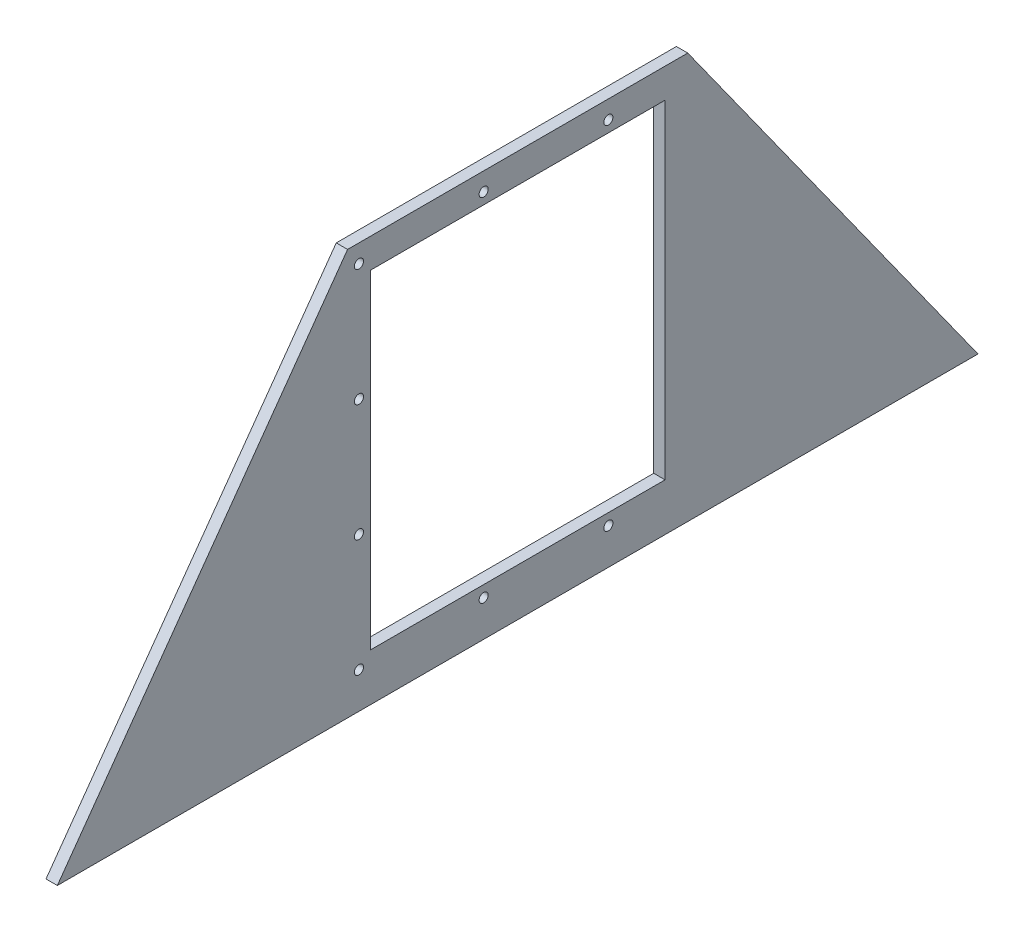
ISO-10303-21;
HEADER;
FILE_DESCRIPTION(('STEP AP214'),'2;1');
FILE_NAME('part.step','',(''),(''),'','','');
FILE_SCHEMA(('AUTOMOTIVE_DESIGN { 1 0 10303 214 1 1 1 1 }'));
ENDSEC;
DATA;
#1=APPLICATION_CONTEXT('core data for automotive mechanical design processes');
#2=APPLICATION_PROTOCOL_DEFINITION('international standard','automotive_design',2000,#1);
#3=PRODUCT_CONTEXT('',#1,'mechanical');
#4=PRODUCT('Part','Part','',(#3));
#5=PRODUCT_RELATED_PRODUCT_CATEGORY('part','',(#4));
#6=PRODUCT_DEFINITION_FORMATION('','',#4);
#7=PRODUCT_DEFINITION_CONTEXT('part definition',#1,'design');
#8=PRODUCT_DEFINITION('design','',#6,#7);
#9=PRODUCT_DEFINITION_SHAPE('','',#8);
#10=(LENGTH_UNIT() NAMED_UNIT(*) SI_UNIT(.MILLI.,.METRE.));
#11=(NAMED_UNIT(*) PLANE_ANGLE_UNIT() SI_UNIT($,.RADIAN.));
#12=(NAMED_UNIT(*) SI_UNIT($,.STERADIAN.) SOLID_ANGLE_UNIT());
#13=UNCERTAINTY_MEASURE_WITH_UNIT(LENGTH_MEASURE(1.E-05),#10,'distance_accuracy_value','');
#14=(GEOMETRIC_REPRESENTATION_CONTEXT(3) GLOBAL_UNCERTAINTY_ASSIGNED_CONTEXT((#13)) GLOBAL_UNIT_ASSIGNED_CONTEXT((#10,
#11,#12)) REPRESENTATION_CONTEXT('',''));
#15=CARTESIAN_POINT('',(0.,0.,0.));
#16=DIRECTION('',(0.,0.,1.));
#17=DIRECTION('',(1.,0.,0.));
#18=AXIS2_PLACEMENT_3D('',#15,#16,#17);
#19=CARTESIAN_POINT('',(6.35,0.,257.81));
#20=DIRECTION('',(0.,-0.581818181818182,-0.813318881685274));
#21=DIRECTION('',(0.,0.813318881685274,-0.581818181818182));
#22=AXIS2_PLACEMENT_3D('',#19,#20,#21);
#23=PLANE('',#22);
#24=DIRECTION('',(0.,-0.813318881685274,0.581818181818182));
#25=VECTOR('',#24,1.);
#26=CARTESIAN_POINT('',(0.,0.,257.81));
#27=LINE('',#26,#25);
#28=CARTESIAN_POINT('',(0.,227.241295542866,95.25));
#29=VERTEX_POINT('',#28);
#30=CARTESIAN_POINT('',(0.,0.,257.81));
#31=VERTEX_POINT('',#30);
#32=EDGE_CURVE('E135',#29,#31,#27,.T.);
#33=ORIENTED_EDGE('',*,*,#32,.T.);
#34=DIRECTION('',(-1.,0.,0.));
#35=VECTOR('',#34,1.);
#36=CARTESIAN_POINT('',(6.35,0.,257.81));
#37=LINE('',#36,#35);
#38=CARTESIAN_POINT('',(6.35,0.,257.81));
#39=VERTEX_POINT('',#38);
#40=EDGE_CURVE('E11',#39,#31,#37,.T.);
#41=ORIENTED_EDGE('',*,*,#40,.F.);
#42=DIRECTION('',(0.,-0.813318881685274,0.581818181818182));
#43=VECTOR('',#42,1.);
#44=CARTESIAN_POINT('',(6.35,0.,257.81));
#45=LINE('',#44,#43);
#46=CARTESIAN_POINT('',(6.35,227.241295542866,95.25));
#47=VERTEX_POINT('',#46);
#48=EDGE_CURVE('E139',#47,#39,#45,.T.);
#49=ORIENTED_EDGE('',*,*,#48,.F.);
#50=DIRECTION('',(-1.,0.,0.));
#51=VECTOR('',#50,1.);
#52=CARTESIAN_POINT('',(6.35,227.241295542866,95.25));
#53=LINE('',#52,#51);
#54=EDGE_CURVE('E149',#47,#29,#53,.T.);
#55=ORIENTED_EDGE('',*,*,#54,.T.);
#56=EDGE_LOOP('',(#33,#41,#49,#55));
#57=FACE_BOUND('',#56,.T.);
#58=ADVANCED_FACE('F35',(#57),#23,.F.);
#59=CARTESIAN_POINT('',(6.35,0.,-257.81));
#60=DIRECTION('',(0.,1.,0.));
#61=DIRECTION('',(0.,0.,1.));
#62=AXIS2_PLACEMENT_3D('',#59,#60,#61);
#63=PLANE('',#62);
#64=DIRECTION('',(0.,0.,-1.));
#65=VECTOR('',#64,1.);
#66=CARTESIAN_POINT('',(0.,0.,-257.81));
#67=LINE('',#66,#65);
#68=CARTESIAN_POINT('',(0.,0.,-257.81));
#69=VERTEX_POINT('',#68);
#70=EDGE_CURVE('E152',#31,#69,#67,.T.);
#71=ORIENTED_EDGE('',*,*,#70,.T.);
#72=DIRECTION('',(-1.,0.,0.));
#73=VECTOR('',#72,1.);
#74=CARTESIAN_POINT('',(6.35,0.,-257.81));
#75=LINE('',#74,#73);
#76=CARTESIAN_POINT('',(6.35,0.,-257.81));
#77=VERTEX_POINT('',#76);
#78=EDGE_CURVE('E42',#77,#69,#75,.T.);
#79=ORIENTED_EDGE('',*,*,#78,.F.);
#80=DIRECTION('',(0.,0.,-1.));
#81=VECTOR('',#80,1.);
#82=CARTESIAN_POINT('',(6.35,0.,-257.81));
#83=LINE('',#82,#81);
#84=EDGE_CURVE('E142',#39,#77,#83,.T.);
#85=ORIENTED_EDGE('',*,*,#84,.F.);
#86=ORIENTED_EDGE('',*,*,#40,.T.);
#87=EDGE_LOOP('',(#71,#79,#85,#86));
#88=FACE_BOUND('',#87,.T.);
#89=ADVANCED_FACE('F180',(#88),#63,.F.);
#90=CARTESIAN_POINT('',(6.35,0.,-257.81));
#91=DIRECTION('',(0.,-0.581818181818182,0.813318881685274));
#92=DIRECTION('',(0.,-0.813318881685274,-0.581818181818182));
#93=AXIS2_PLACEMENT_3D('',#90,#91,#92);
#94=PLANE('',#93);
#95=DIRECTION('',(0.,0.813318881685274,0.581818181818182));
#96=VECTOR('',#95,1.);
#97=CARTESIAN_POINT('',(0.,0.,-257.81));
#98=LINE('',#97,#96);
#99=CARTESIAN_POINT('',(0.,227.241295542866,-95.25));
#100=VERTEX_POINT('',#99);
#101=EDGE_CURVE('E154',#69,#100,#98,.T.);
#102=ORIENTED_EDGE('',*,*,#101,.T.);
#103=DIRECTION('',(-1.,0.,0.));
#104=VECTOR('',#103,1.);
#105=CARTESIAN_POINT('',(6.35,227.241295542866,-95.25));
#106=LINE('',#105,#104);
#107=CARTESIAN_POINT('',(6.35,227.241295542866,-95.25));
#108=VERTEX_POINT('',#107);
#109=EDGE_CURVE('E159',#108,#100,#106,.T.);
#110=ORIENTED_EDGE('',*,*,#109,.F.);
#111=DIRECTION('',(0.,0.813318881685274,0.581818181818182));
#112=VECTOR('',#111,1.);
#113=CARTESIAN_POINT('',(6.35,0.,-257.81));
#114=LINE('',#113,#112);
#115=EDGE_CURVE('E145',#77,#108,#114,.T.);
#116=ORIENTED_EDGE('',*,*,#115,.F.);
#117=ORIENTED_EDGE('',*,*,#78,.T.);
#118=EDGE_LOOP('',(#102,#110,#116,#117));
#119=FACE_BOUND('',#118,.T.);
#120=ADVANCED_FACE('F166',(#119),#94,.F.);
#121=CARTESIAN_POINT('',(6.35,227.241295542866,95.25));
#122=DIRECTION('',(0.,-1.,0.));
#123=DIRECTION('',(0.,0.,-1.));
#124=AXIS2_PLACEMENT_3D('',#121,#122,#123);
#125=PLANE('',#124);
#126=DIRECTION('',(0.,0.,1.));
#127=VECTOR('',#126,1.);
#128=CARTESIAN_POINT('',(0.,227.241295542866,95.25));
#129=LINE('',#128,#127);
#130=EDGE_CURVE('E143',#100,#29,#129,.T.);
#131=ORIENTED_EDGE('',*,*,#130,.T.);
#132=ORIENTED_EDGE('',*,*,#54,.F.);
#133=DIRECTION('',(0.,0.,1.));
#134=VECTOR('',#133,1.);
#135=CARTESIAN_POINT('',(6.35,227.241295542866,95.25));
#136=LINE('',#135,#134);
#137=EDGE_CURVE('E147',#108,#47,#136,.T.);
#138=ORIENTED_EDGE('',*,*,#137,.F.);
#139=ORIENTED_EDGE('',*,*,#109,.T.);
#140=EDGE_LOOP('',(#131,#132,#138,#139));
#141=FACE_BOUND('',#140,.T.);
#142=ADVANCED_FACE('F173',(#141),#125,.F.);
#143=CARTESIAN_POINT('',(6.35,0.,0.));
#144=DIRECTION('',(1.,0.,0.));
#145=DIRECTION('',(0.,0.,-1.));
#146=AXIS2_PLACEMENT_3D('',#143,#144,#145);
#147=PLANE('',#146);
#148=CARTESIAN_POINT('',(6.35,217.081295542866,19.05));
#149=DIRECTION('',(1.,0.,0.));
#150=DIRECTION('',(0.,0.,-1.));
#151=AXIS2_PLACEMENT_3D('',#148,#149,#150);
#152=CIRCLE('',#151,2.55269999999999);
#153=CARTESIAN_POINT('',(6.35,217.081295542866,16.4973));
#154=VERTEX_POINT('',#153);
#155=EDGE_CURVE('E243',#154,#154,#152,.T.);
#156=ORIENTED_EDGE('',*,*,#155,.F.);
#157=EDGE_LOOP('',(#156));
#158=FACE_BOUND('',#157,.T.);
#159=CARTESIAN_POINT('',(6.35,217.081295542866,-50.8));
#160=DIRECTION('',(1.,0.,0.));
#161=DIRECTION('',(0.,0.,-1.));
#162=AXIS2_PLACEMENT_3D('',#159,#160,#161);
#163=CIRCLE('',#162,2.55269999999999);
#164=CARTESIAN_POINT('',(6.35,217.081295542866,-53.3527));
#165=VERTEX_POINT('',#164);
#166=EDGE_CURVE('E253',#165,#165,#163,.T.);
#167=ORIENTED_EDGE('',*,*,#166,.F.);
#168=EDGE_LOOP('',(#167));
#169=FACE_BOUND('',#168,.T.);
#170=CARTESIAN_POINT('',(6.35,20.2312955428655,-50.8000000000001));
#171=DIRECTION('',(1.,0.,0.));
#172=DIRECTION('',(0.,0.,-1.));
#173=AXIS2_PLACEMENT_3D('',#170,#171,#172);
#174=CIRCLE('',#173,2.5527);
#175=CARTESIAN_POINT('',(6.35,20.2312955428655,-53.3527000000001));
#176=VERTEX_POINT('',#175);
#177=EDGE_CURVE('E259',#176,#176,#174,.T.);
#178=ORIENTED_EDGE('',*,*,#177,.F.);
#179=EDGE_LOOP('',(#178));
#180=FACE_BOUND('',#179,.T.);
#181=CARTESIAN_POINT('',(6.35,20.2312955428655,19.05));
#182=DIRECTION('',(1.,0.,0.));
#183=DIRECTION('',(0.,0.,-1.));
#184=AXIS2_PLACEMENT_3D('',#181,#182,#183);
#185=CIRCLE('',#184,2.5527);
#186=CARTESIAN_POINT('',(6.35,20.2312955428655,16.4973));
#187=VERTEX_POINT('',#186);
#188=EDGE_CURVE('E265',#187,#187,#185,.T.);
#189=ORIENTED_EDGE('',*,*,#188,.F.);
#190=EDGE_LOOP('',(#189));
#191=FACE_BOUND('',#190,.T.);
#192=CARTESIAN_POINT('',(6.35,20.2312955428655,88.8999999999999));
#193=DIRECTION('',(1.,0.,0.));
#194=DIRECTION('',(0.,0.,-1.));
#195=AXIS2_PLACEMENT_3D('',#192,#193,#194);
#196=CIRCLE('',#195,2.5527);
#197=CARTESIAN_POINT('',(6.35,20.2312955428655,86.3473));
#198=VERTEX_POINT('',#197);
#199=EDGE_CURVE('E271',#198,#198,#196,.T.);
#200=ORIENTED_EDGE('',*,*,#199,.F.);
#201=EDGE_LOOP('',(#200));
#202=FACE_BOUND('',#201,.T.);
#203=CARTESIAN_POINT('',(6.35,85.8479622095322,88.9));
#204=DIRECTION('',(1.,0.,0.));
#205=DIRECTION('',(0.,0.,-1.));
#206=AXIS2_PLACEMENT_3D('',#203,#204,#205);
#207=CIRCLE('',#206,2.55269999999999);
#208=CARTESIAN_POINT('',(6.35,85.8479622095322,86.3473));
#209=VERTEX_POINT('',#208);
#210=EDGE_CURVE('E277',#209,#209,#207,.T.);
#211=ORIENTED_EDGE('',*,*,#210,.F.);
#212=EDGE_LOOP('',(#211));
#213=FACE_BOUND('',#212,.T.);
#214=CARTESIAN_POINT('',(6.35,151.464628876199,88.9));
#215=DIRECTION('',(1.,0.,0.));
#216=DIRECTION('',(0.,0.,-1.));
#217=AXIS2_PLACEMENT_3D('',#214,#215,#216);
#218=CIRCLE('',#217,2.55269999999999);
#219=CARTESIAN_POINT('',(6.35,151.464628876199,86.3473));
#220=VERTEX_POINT('',#219);
#221=EDGE_CURVE('E283',#220,#220,#218,.T.);
#222=ORIENTED_EDGE('',*,*,#221,.F.);
#223=EDGE_LOOP('',(#222));
#224=FACE_BOUND('',#223,.T.);
#225=CARTESIAN_POINT('',(6.35,217.081295542866,88.9));
#226=DIRECTION('',(1.,0.,0.));
#227=DIRECTION('',(0.,0.,-1.));
#228=AXIS2_PLACEMENT_3D('',#225,#226,#227);
#229=CIRCLE('',#228,2.55269999999999);
#230=CARTESIAN_POINT('',(6.35,217.081295542866,86.3473));
#231=VERTEX_POINT('',#230);
#232=EDGE_CURVE('E123',#231,#231,#229,.T.);
#233=ORIENTED_EDGE('',*,*,#232,.F.);
#234=EDGE_LOOP('',(#233));
#235=FACE_BOUND('',#234,.T.);
#236=DIRECTION('',(0.,-1.,0.));
#237=VECTOR('',#236,1.);
#238=CARTESIAN_POINT('',(6.35,210.731295542866,82.55));
#239=LINE('',#238,#237);
#240=CARTESIAN_POINT('',(6.35,210.731295542866,82.55));
#241=VERTEX_POINT('',#240);
#242=CARTESIAN_POINT('',(6.35,26.5812955428656,82.55));
#243=VERTEX_POINT('',#242);
#244=EDGE_CURVE('E49',#241,#243,#239,.T.);
#245=ORIENTED_EDGE('',*,*,#244,.F.);
#246=DIRECTION('',(0.,0.,1.));
#247=VECTOR('',#246,1.);
#248=CARTESIAN_POINT('',(6.35,210.731295542866,82.55));
#249=LINE('',#248,#247);
#250=CARTESIAN_POINT('',(6.35,210.731295542866,-82.55));
#251=VERTEX_POINT('',#250);
#252=EDGE_CURVE('E117',#251,#241,#249,.T.);
#253=ORIENTED_EDGE('',*,*,#252,.F.);
#254=DIRECTION('',(0.,1.,0.));
#255=VECTOR('',#254,1.);
#256=CARTESIAN_POINT('',(6.35,210.731295542866,-82.55));
#257=LINE('',#256,#255);
#258=CARTESIAN_POINT('',(6.35,26.5812955428656,-82.55));
#259=VERTEX_POINT('',#258);
#260=EDGE_CURVE('E120',#259,#251,#257,.T.);
#261=ORIENTED_EDGE('',*,*,#260,.F.);
#262=DIRECTION('',(0.,0.,-1.));
#263=VECTOR('',#262,1.);
#264=CARTESIAN_POINT('',(6.35,26.5812955428656,82.55));
#265=LINE('',#264,#263);
#266=EDGE_CURVE('E129',#243,#259,#265,.T.);
#267=ORIENTED_EDGE('',*,*,#266,.F.);
#268=EDGE_LOOP('',(#245,#253,#261,#267));
#269=FACE_BOUND('',#268,.T.);
#270=ORIENTED_EDGE('',*,*,#48,.T.);
#271=ORIENTED_EDGE('',*,*,#84,.T.);
#272=ORIENTED_EDGE('',*,*,#115,.T.);
#273=ORIENTED_EDGE('',*,*,#137,.T.);
#274=EDGE_LOOP('',(#270,#271,#272,#273));
#275=FACE_BOUND('',#274,.T.);
#276=ADVANCED_FACE('F179',(#158,#169,#180,#191,#202,#213,#224,#235,#269,#275),#147,.T.);
#277=CARTESIAN_POINT('',(0.,0.,0.));
#278=DIRECTION('',(1.,0.,0.));
#279=DIRECTION('',(0.,0.,-1.));
#280=AXIS2_PLACEMENT_3D('',#277,#278,#279);
#281=PLANE('',#280);
#282=CARTESIAN_POINT('',(0.,217.081295542866,19.05));
#283=DIRECTION('',(-1.,0.,0.));
#284=DIRECTION('',(0.,0.,1.));
#285=AXIS2_PLACEMENT_3D('',#282,#283,#284);
#286=CIRCLE('',#285,2.55269999999999);
#287=CARTESIAN_POINT('',(0.,217.081295542866,21.6027));
#288=VERTEX_POINT('',#287);
#289=EDGE_CURVE('E246',#288,#288,#286,.T.);
#290=ORIENTED_EDGE('',*,*,#289,.F.);
#291=EDGE_LOOP('',(#290));
#292=FACE_BOUND('',#291,.T.);
#293=CARTESIAN_POINT('',(0.,217.081295542866,-50.8));
#294=DIRECTION('',(-1.,0.,0.));
#295=DIRECTION('',(0.,0.,1.));
#296=AXIS2_PLACEMENT_3D('',#293,#294,#295);
#297=CIRCLE('',#296,2.55269999999999);
#298=CARTESIAN_POINT('',(0.,217.081295542866,-48.2473));
#299=VERTEX_POINT('',#298);
#300=EDGE_CURVE('E248',#299,#299,#297,.T.);
#301=ORIENTED_EDGE('',*,*,#300,.F.);
#302=EDGE_LOOP('',(#301));
#303=FACE_BOUND('',#302,.T.);
#304=CARTESIAN_POINT('',(0.,20.2312955428655,-50.8000000000001));
#305=DIRECTION('',(-1.,0.,0.));
#306=DIRECTION('',(0.,0.,1.));
#307=AXIS2_PLACEMENT_3D('',#304,#305,#306);
#308=CIRCLE('',#307,2.5527);
#309=CARTESIAN_POINT('',(0.,20.2312955428655,-48.2473000000001));
#310=VERTEX_POINT('',#309);
#311=EDGE_CURVE('E256',#310,#310,#308,.T.);
#312=ORIENTED_EDGE('',*,*,#311,.F.);
#313=EDGE_LOOP('',(#312));
#314=FACE_BOUND('',#313,.T.);
#315=CARTESIAN_POINT('',(0.,20.2312955428655,19.05));
#316=DIRECTION('',(-1.,0.,0.));
#317=DIRECTION('',(0.,0.,1.));
#318=AXIS2_PLACEMENT_3D('',#315,#316,#317);
#319=CIRCLE('',#318,2.5527);
#320=CARTESIAN_POINT('',(0.,20.2312955428655,21.6027));
#321=VERTEX_POINT('',#320);
#322=EDGE_CURVE('E262',#321,#321,#319,.T.);
#323=ORIENTED_EDGE('',*,*,#322,.F.);
#324=EDGE_LOOP('',(#323));
#325=FACE_BOUND('',#324,.T.);
#326=CARTESIAN_POINT('',(0.,20.2312955428655,88.8999999999999));
#327=DIRECTION('',(-1.,0.,0.));
#328=DIRECTION('',(0.,0.,1.));
#329=AXIS2_PLACEMENT_3D('',#326,#327,#328);
#330=CIRCLE('',#329,2.5527);
#331=CARTESIAN_POINT('',(0.,20.2312955428655,91.4526999999999));
#332=VERTEX_POINT('',#331);
#333=EDGE_CURVE('E268',#332,#332,#330,.T.);
#334=ORIENTED_EDGE('',*,*,#333,.F.);
#335=EDGE_LOOP('',(#334));
#336=FACE_BOUND('',#335,.T.);
#337=CARTESIAN_POINT('',(0.,85.8479622095322,88.9));
#338=DIRECTION('',(-1.,0.,0.));
#339=DIRECTION('',(0.,0.,1.));
#340=AXIS2_PLACEMENT_3D('',#337,#338,#339);
#341=CIRCLE('',#340,2.55269999999999);
#342=CARTESIAN_POINT('',(0.,85.8479622095322,91.4527));
#343=VERTEX_POINT('',#342);
#344=EDGE_CURVE('E274',#343,#343,#341,.T.);
#345=ORIENTED_EDGE('',*,*,#344,.F.);
#346=EDGE_LOOP('',(#345));
#347=FACE_BOUND('',#346,.T.);
#348=CARTESIAN_POINT('',(0.,151.464628876199,88.9));
#349=DIRECTION('',(-1.,0.,0.));
#350=DIRECTION('',(0.,0.,1.));
#351=AXIS2_PLACEMENT_3D('',#348,#349,#350);
#352=CIRCLE('',#351,2.55269999999999);
#353=CARTESIAN_POINT('',(0.,151.464628876199,91.4527));
#354=VERTEX_POINT('',#353);
#355=EDGE_CURVE('E280',#354,#354,#352,.T.);
#356=ORIENTED_EDGE('',*,*,#355,.F.);
#357=EDGE_LOOP('',(#356));
#358=FACE_BOUND('',#357,.T.);
#359=CARTESIAN_POINT('',(0.,217.081295542866,88.9));
#360=DIRECTION('',(-1.,0.,0.));
#361=DIRECTION('',(0.,0.,1.));
#362=AXIS2_PLACEMENT_3D('',#359,#360,#361);
#363=CIRCLE('',#362,2.55269999999999);
#364=CARTESIAN_POINT('',(0.,217.081295542866,91.4527));
#365=VERTEX_POINT('',#364);
#366=EDGE_CURVE('E285',#365,#365,#363,.T.);
#367=ORIENTED_EDGE('',*,*,#366,.F.);
#368=EDGE_LOOP('',(#367));
#369=FACE_BOUND('',#368,.T.);
#370=DIRECTION('',(0.,0.,1.));
#371=VECTOR('',#370,1.);
#372=CARTESIAN_POINT('',(0.,210.731295542866,82.55));
#373=LINE('',#372,#371);
#374=CARTESIAN_POINT('',(0.,210.731295542866,-82.55));
#375=VERTEX_POINT('',#374);
#376=CARTESIAN_POINT('',(0.,210.731295542866,82.55));
#377=VERTEX_POINT('',#376);
#378=EDGE_CURVE('E107',#375,#377,#373,.T.);
#379=ORIENTED_EDGE('',*,*,#378,.T.);
#380=DIRECTION('',(0.,-1.,0.));
#381=VECTOR('',#380,1.);
#382=CARTESIAN_POINT('',(0.,210.731295542866,82.55));
#383=LINE('',#382,#381);
#384=CARTESIAN_POINT('',(0.,26.5812955428656,82.55));
#385=VERTEX_POINT('',#384);
#386=EDGE_CURVE('E101',#377,#385,#383,.T.);
#387=ORIENTED_EDGE('',*,*,#386,.T.);
#388=DIRECTION('',(0.,0.,-1.));
#389=VECTOR('',#388,1.);
#390=CARTESIAN_POINT('',(0.,26.5812955428656,82.55));
#391=LINE('',#390,#389);
#392=CARTESIAN_POINT('',(0.,26.5812955428656,-82.55));
#393=VERTEX_POINT('',#392);
#394=EDGE_CURVE('E110',#385,#393,#391,.T.);
#395=ORIENTED_EDGE('',*,*,#394,.T.);
#396=DIRECTION('',(0.,1.,0.));
#397=VECTOR('',#396,1.);
#398=CARTESIAN_POINT('',(0.,210.731295542866,-82.55));
#399=LINE('',#398,#397);
#400=EDGE_CURVE('E57',#393,#375,#399,.T.);
#401=ORIENTED_EDGE('',*,*,#400,.T.);
#402=EDGE_LOOP('',(#379,#387,#395,#401));
#403=FACE_BOUND('',#402,.T.);
#404=ORIENTED_EDGE('',*,*,#32,.F.);
#405=ORIENTED_EDGE('',*,*,#130,.F.);
#406=ORIENTED_EDGE('',*,*,#101,.F.);
#407=ORIENTED_EDGE('',*,*,#70,.F.);
#408=EDGE_LOOP('',(#404,#405,#406,#407));
#409=FACE_BOUND('',#408,.T.);
#410=ADVANCED_FACE('F114',(#292,#303,#314,#325,#336,#347,#358,#369,#403,#409),#281,.F.);
#411=CARTESIAN_POINT('',(0.,210.731295542866,82.55));
#412=DIRECTION('',(0.,0.,1.));
#413=DIRECTION('',(0.,-1.,0.));
#414=AXIS2_PLACEMENT_3D('',#411,#412,#413);
#415=PLANE('',#414);
#416=ORIENTED_EDGE('',*,*,#244,.T.);
#417=DIRECTION('',(1.,0.,0.));
#418=VECTOR('',#417,1.);
#419=CARTESIAN_POINT('',(0.,26.5812955428656,82.55));
#420=LINE('',#419,#418);
#421=EDGE_CURVE('E97',#385,#243,#420,.T.);
#422=ORIENTED_EDGE('',*,*,#421,.F.);
#423=ORIENTED_EDGE('',*,*,#386,.F.);
#424=DIRECTION('',(1.,0.,0.));
#425=VECTOR('',#424,1.);
#426=CARTESIAN_POINT('',(0.,210.731295542866,82.55));
#427=LINE('',#426,#425);
#428=EDGE_CURVE('E133',#377,#241,#427,.T.);
#429=ORIENTED_EDGE('',*,*,#428,.T.);
#430=EDGE_LOOP('',(#416,#422,#423,#429));
#431=FACE_BOUND('',#430,.T.);
#432=ADVANCED_FACE('F99',(#431),#415,.F.);
#433=CARTESIAN_POINT('',(0.,210.731295542866,82.55));
#434=DIRECTION('',(0.,1.,0.));
#435=DIRECTION('',(0.,0.,1.));
#436=AXIS2_PLACEMENT_3D('',#433,#434,#435);
#437=PLANE('',#436);
#438=ORIENTED_EDGE('',*,*,#252,.T.);
#439=ORIENTED_EDGE('',*,*,#428,.F.);
#440=ORIENTED_EDGE('',*,*,#378,.F.);
#441=DIRECTION('',(1.,0.,0.));
#442=VECTOR('',#441,1.);
#443=CARTESIAN_POINT('',(0.,210.731295542866,-82.55));
#444=LINE('',#443,#442);
#445=EDGE_CURVE('E136',#375,#251,#444,.T.);
#446=ORIENTED_EDGE('',*,*,#445,.T.);
#447=EDGE_LOOP('',(#438,#439,#440,#446));
#448=FACE_BOUND('',#447,.T.);
#449=ADVANCED_FACE('F198',(#448),#437,.F.);
#450=CARTESIAN_POINT('',(0.,210.731295542866,-82.55));
#451=DIRECTION('',(0.,0.,-1.));
#452=DIRECTION('',(0.,1.,0.));
#453=AXIS2_PLACEMENT_3D('',#450,#451,#452);
#454=PLANE('',#453);
#455=ORIENTED_EDGE('',*,*,#260,.T.);
#456=ORIENTED_EDGE('',*,*,#445,.F.);
#457=ORIENTED_EDGE('',*,*,#400,.F.);
#458=DIRECTION('',(1.,0.,0.));
#459=VECTOR('',#458,1.);
#460=CARTESIAN_POINT('',(0.,26.5812955428656,-82.55));
#461=LINE('',#460,#459);
#462=EDGE_CURVE('E106',#393,#259,#461,.T.);
#463=ORIENTED_EDGE('',*,*,#462,.T.);
#464=EDGE_LOOP('',(#455,#456,#457,#463));
#465=FACE_BOUND('',#464,.T.);
#466=ADVANCED_FACE('F202',(#465),#454,.F.);
#467=CARTESIAN_POINT('',(0.,26.5812955428656,82.55));
#468=DIRECTION('',(0.,-1.,0.));
#469=DIRECTION('',(0.,0.,-1.));
#470=AXIS2_PLACEMENT_3D('',#467,#468,#469);
#471=PLANE('',#470);
#472=ORIENTED_EDGE('',*,*,#266,.T.);
#473=ORIENTED_EDGE('',*,*,#462,.F.);
#474=ORIENTED_EDGE('',*,*,#394,.F.);
#475=ORIENTED_EDGE('',*,*,#421,.T.);
#476=EDGE_LOOP('',(#472,#473,#474,#475));
#477=FACE_BOUND('',#476,.T.);
#478=ADVANCED_FACE('F111',(#477),#471,.F.);
#479=CARTESIAN_POINT('',(0.,217.081295542866,88.9));
#480=DIRECTION('',(-1.,0.,0.));
#481=DIRECTION('',(0.,0.,1.));
#482=AXIS2_PLACEMENT_3D('',#479,#480,#481);
#483=CYLINDRICAL_SURFACE('',#482,2.55269999999999);
#484=ORIENTED_EDGE('',*,*,#232,.T.);
#485=EDGE_LOOP('',(#484));
#486=FACE_BOUND('',#485,.T.);
#487=ORIENTED_EDGE('',*,*,#366,.T.);
#488=EDGE_LOOP('',(#487));
#489=FACE_BOUND('',#488,.T.);
#490=ADVANCED_FACE('F201',(#486,#489),#483,.F.);
#491=CARTESIAN_POINT('',(0.,151.464628876199,88.9));
#492=DIRECTION('',(-1.,0.,0.));
#493=DIRECTION('',(0.,0.,1.));
#494=AXIS2_PLACEMENT_3D('',#491,#492,#493);
#495=CYLINDRICAL_SURFACE('',#494,2.55269999999999);
#496=ORIENTED_EDGE('',*,*,#221,.T.);
#497=EDGE_LOOP('',(#496));
#498=FACE_BOUND('',#497,.T.);
#499=ORIENTED_EDGE('',*,*,#355,.T.);
#500=EDGE_LOOP('',(#499));
#501=FACE_BOUND('',#500,.T.);
#502=ADVANCED_FACE('F210',(#498,#501),#495,.F.);
#503=CARTESIAN_POINT('',(0.,85.8479622095322,88.9));
#504=DIRECTION('',(-1.,0.,0.));
#505=DIRECTION('',(0.,0.,1.));
#506=AXIS2_PLACEMENT_3D('',#503,#504,#505);
#507=CYLINDRICAL_SURFACE('',#506,2.55269999999999);
#508=ORIENTED_EDGE('',*,*,#210,.T.);
#509=EDGE_LOOP('',(#508));
#510=FACE_BOUND('',#509,.T.);
#511=ORIENTED_EDGE('',*,*,#344,.T.);
#512=EDGE_LOOP('',(#511));
#513=FACE_BOUND('',#512,.T.);
#514=ADVANCED_FACE('F214',(#510,#513),#507,.F.);
#515=CARTESIAN_POINT('',(0.,20.2312955428655,88.8999999999999));
#516=DIRECTION('',(-1.,0.,0.));
#517=DIRECTION('',(0.,0.,1.));
#518=AXIS2_PLACEMENT_3D('',#515,#516,#517);
#519=CYLINDRICAL_SURFACE('',#518,2.5527);
#520=ORIENTED_EDGE('',*,*,#199,.T.);
#521=EDGE_LOOP('',(#520));
#522=FACE_BOUND('',#521,.T.);
#523=ORIENTED_EDGE('',*,*,#333,.T.);
#524=EDGE_LOOP('',(#523));
#525=FACE_BOUND('',#524,.T.);
#526=ADVANCED_FACE('F218',(#522,#525),#519,.F.);
#527=CARTESIAN_POINT('',(0.,20.2312955428655,19.05));
#528=DIRECTION('',(-1.,0.,0.));
#529=DIRECTION('',(0.,0.,1.));
#530=AXIS2_PLACEMENT_3D('',#527,#528,#529);
#531=CYLINDRICAL_SURFACE('',#530,2.5527);
#532=ORIENTED_EDGE('',*,*,#188,.T.);
#533=EDGE_LOOP('',(#532));
#534=FACE_BOUND('',#533,.T.);
#535=ORIENTED_EDGE('',*,*,#322,.T.);
#536=EDGE_LOOP('',(#535));
#537=FACE_BOUND('',#536,.T.);
#538=ADVANCED_FACE('F222',(#534,#537),#531,.F.);
#539=CARTESIAN_POINT('',(0.,20.2312955428655,-50.8000000000001));
#540=DIRECTION('',(-1.,0.,0.));
#541=DIRECTION('',(0.,0.,1.));
#542=AXIS2_PLACEMENT_3D('',#539,#540,#541);
#543=CYLINDRICAL_SURFACE('',#542,2.5527);
#544=ORIENTED_EDGE('',*,*,#177,.T.);
#545=EDGE_LOOP('',(#544));
#546=FACE_BOUND('',#545,.T.);
#547=ORIENTED_EDGE('',*,*,#311,.T.);
#548=EDGE_LOOP('',(#547));
#549=FACE_BOUND('',#548,.T.);
#550=ADVANCED_FACE('F226',(#546,#549),#543,.F.);
#551=CARTESIAN_POINT('',(0.,217.081295542866,-50.8));
#552=DIRECTION('',(-1.,0.,0.));
#553=DIRECTION('',(0.,0.,1.));
#554=AXIS2_PLACEMENT_3D('',#551,#552,#553);
#555=CYLINDRICAL_SURFACE('',#554,2.55269999999999);
#556=ORIENTED_EDGE('',*,*,#166,.T.);
#557=EDGE_LOOP('',(#556));
#558=FACE_BOUND('',#557,.T.);
#559=ORIENTED_EDGE('',*,*,#300,.T.);
#560=EDGE_LOOP('',(#559));
#561=FACE_BOUND('',#560,.T.);
#562=ADVANCED_FACE('F230',(#558,#561),#555,.F.);
#563=CARTESIAN_POINT('',(0.,217.081295542866,19.05));
#564=DIRECTION('',(-1.,0.,0.));
#565=DIRECTION('',(0.,0.,1.));
#566=AXIS2_PLACEMENT_3D('',#563,#564,#565);
#567=CYLINDRICAL_SURFACE('',#566,2.55269999999999);
#568=ORIENTED_EDGE('',*,*,#155,.T.);
#569=EDGE_LOOP('',(#568));
#570=FACE_BOUND('',#569,.T.);
#571=ORIENTED_EDGE('',*,*,#289,.T.);
#572=EDGE_LOOP('',(#571));
#573=FACE_BOUND('',#572,.T.);
#574=ADVANCED_FACE('F234',(#570,#573),#567,.F.);
#575=CLOSED_SHELL('',(#58,#89,#120,#142,#276,#410,#432,#449,#466,#478,#490,#502,#514,#526,#538,
#550,#562,#574));
#576=MANIFOLD_SOLID_BREP('B2',#575);
#577=ADVANCED_BREP_SHAPE_REPRESENTATION('',(#18,#576),#14);
#578=SHAPE_DEFINITION_REPRESENTATION(#9,#577);
ENDSEC;
END-ISO-10303-21;
